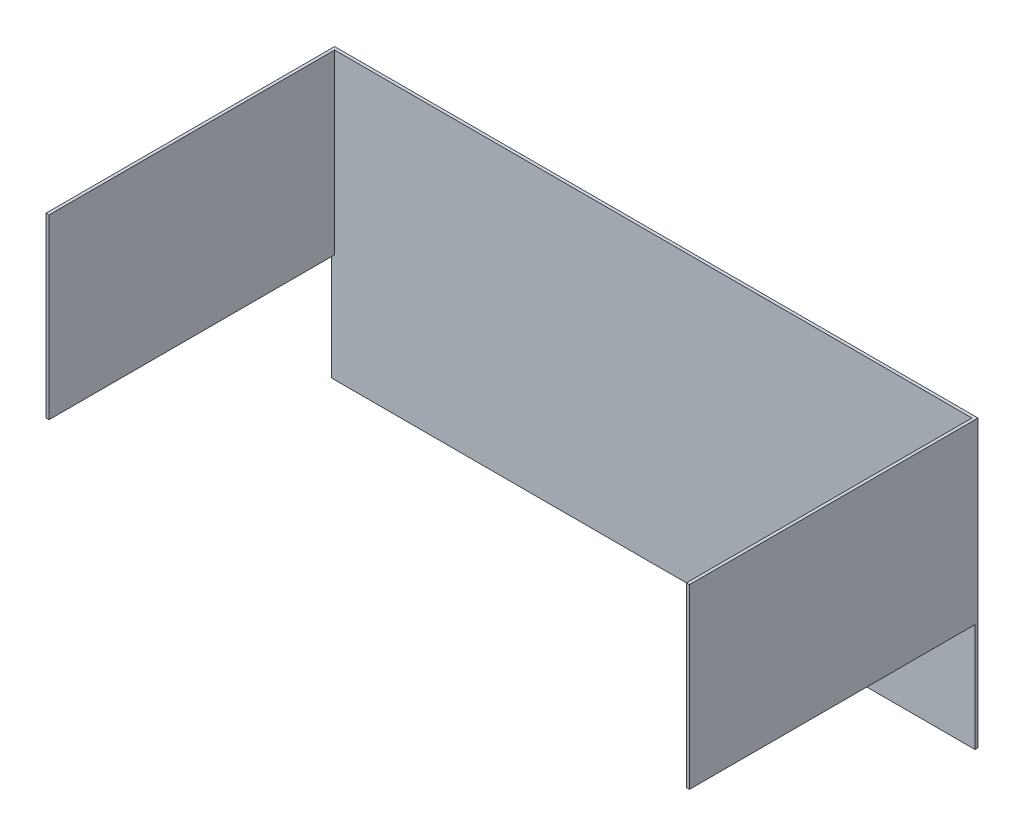
ISO-10303-21;
HEADER;
FILE_DESCRIPTION(('STEP AP214'),'2;1');
FILE_NAME('part.step','',(''),(''),'','','');
FILE_SCHEMA(('AUTOMOTIVE_DESIGN { 1 0 10303 214 1 1 1 1 }'));
ENDSEC;
DATA;
#1=APPLICATION_CONTEXT('core data for automotive mechanical design processes');
#2=APPLICATION_PROTOCOL_DEFINITION('international standard','automotive_design',2000,#1);
#3=PRODUCT_CONTEXT('',#1,'mechanical');
#4=PRODUCT('Part','Part','',(#3));
#5=PRODUCT_RELATED_PRODUCT_CATEGORY('part','',(#4));
#6=PRODUCT_DEFINITION_FORMATION('','',#4);
#7=PRODUCT_DEFINITION_CONTEXT('part definition',#1,'design');
#8=PRODUCT_DEFINITION('design','',#6,#7);
#9=PRODUCT_DEFINITION_SHAPE('','',#8);
#10=(LENGTH_UNIT() NAMED_UNIT(*) SI_UNIT(.MILLI.,.METRE.));
#11=(NAMED_UNIT(*) PLANE_ANGLE_UNIT() SI_UNIT($,.RADIAN.));
#12=(NAMED_UNIT(*) SI_UNIT($,.STERADIAN.) SOLID_ANGLE_UNIT());
#13=UNCERTAINTY_MEASURE_WITH_UNIT(LENGTH_MEASURE(1.E-05),#10,'distance_accuracy_value','');
#14=(GEOMETRIC_REPRESENTATION_CONTEXT(3) GLOBAL_UNCERTAINTY_ASSIGNED_CONTEXT((#13)) GLOBAL_UNIT_ASSIGNED_CONTEXT((#10,
#11,#12)) REPRESENTATION_CONTEXT('',''));
#15=CARTESIAN_POINT('',(0.,0.,0.));
#16=DIRECTION('',(0.,0.,1.));
#17=DIRECTION('',(1.,0.,0.));
#18=AXIS2_PLACEMENT_3D('',#15,#16,#17);
#19=CARTESIAN_POINT('',(-339.725,301.625,152.4));
#20=DIRECTION('',(1.,0.,0.));
#21=DIRECTION('',(0.,0.,-1.));
#22=AXIS2_PLACEMENT_3D('',#19,#20,#21);
#23=PLANE('',#22);
#24=DIRECTION('',(0.,1.,0.));
#25=VECTOR('',#24,1.);
#26=CARTESIAN_POINT('',(-339.725,114.3,-149.225));
#27=LINE('',#26,#25);
#28=CARTESIAN_POINT('',(-339.725,0.,-149.225));
#29=VERTEX_POINT('',#28);
#30=CARTESIAN_POINT('',(-339.725,114.3,-149.225));
#31=VERTEX_POINT('',#30);
#32=EDGE_CURVE('E207',#29,#31,#27,.T.);
#33=ORIENTED_EDGE('',*,*,#32,.T.);
#34=DIRECTION('',(0.,0.,1.));
#35=VECTOR('',#34,1.);
#36=CARTESIAN_POINT('',(-339.725,114.3,152.4));
#37=LINE('',#36,#35);
#38=CARTESIAN_POINT('',(-339.725,114.3,152.4));
#39=VERTEX_POINT('',#38);
#40=EDGE_CURVE('E196',#31,#39,#37,.T.);
#41=ORIENTED_EDGE('',*,*,#40,.T.);
#42=DIRECTION('',(0.,-1.,0.));
#43=VECTOR('',#42,1.);
#44=CARTESIAN_POINT('',(-339.725,301.625,152.4));
#45=LINE('',#44,#43);
#46=CARTESIAN_POINT('',(-339.725,301.625,152.4));
#47=VERTEX_POINT('',#46);
#48=EDGE_CURVE('E11',#47,#39,#45,.T.);
#49=ORIENTED_EDGE('',*,*,#48,.F.);
#50=DIRECTION('',(0.,0.,1.));
#51=VECTOR('',#50,1.);
#52=CARTESIAN_POINT('',(-339.725,301.625,152.4));
#53=LINE('',#52,#51);
#54=CARTESIAN_POINT('',(-339.725,301.625,-152.4));
#55=VERTEX_POINT('',#54);
#56=EDGE_CURVE('E87',#55,#47,#53,.T.);
#57=ORIENTED_EDGE('',*,*,#56,.F.);
#58=DIRECTION('',(0.,-1.,0.));
#59=VECTOR('',#58,1.);
#60=CARTESIAN_POINT('',(-339.725,301.625,-152.4));
#61=LINE('',#60,#59);
#62=CARTESIAN_POINT('',(-339.725,0.,-152.4));
#63=VERTEX_POINT('',#62);
#64=EDGE_CURVE('E136',#55,#63,#61,.T.);
#65=ORIENTED_EDGE('',*,*,#64,.T.);
#66=DIRECTION('',(0.,0.,1.));
#67=VECTOR('',#66,1.);
#68=CARTESIAN_POINT('',(-339.725,0.,152.4));
#69=LINE('',#68,#67);
#70=EDGE_CURVE('E137',#63,#29,#69,.T.);
#71=ORIENTED_EDGE('',*,*,#70,.T.);
#72=EDGE_LOOP('',(#33,#41,#49,#57,#65,#71));
#73=FACE_BOUND('',#72,.T.);
#74=ADVANCED_FACE('F43',(#73),#23,.F.);
#75=CARTESIAN_POINT('',(-336.55,301.625,152.4));
#76=DIRECTION('',(0.,0.,1.));
#77=DIRECTION('',(1.,0.,0.));
#78=AXIS2_PLACEMENT_3D('',#75,#76,#77);
#79=PLANE('',#78);
#80=DIRECTION('',(1.,0.,0.));
#81=VECTOR('',#80,1.);
#82=CARTESIAN_POINT('',(-339.725,114.3,152.4));
#83=LINE('',#82,#81);
#84=CARTESIAN_POINT('',(-336.55,114.3,152.4));
#85=VERTEX_POINT('',#84);
#86=EDGE_CURVE('E170',#39,#85,#83,.T.);
#87=ORIENTED_EDGE('',*,*,#86,.T.);
#88=DIRECTION('',(0.,-1.,0.));
#89=VECTOR('',#88,1.);
#90=CARTESIAN_POINT('',(-336.55,301.625,152.4));
#91=LINE('',#90,#89);
#92=CARTESIAN_POINT('',(-336.55,301.625,152.4));
#93=VERTEX_POINT('',#92);
#94=EDGE_CURVE('E50',#93,#85,#91,.T.);
#95=ORIENTED_EDGE('',*,*,#94,.F.);
#96=DIRECTION('',(-1.,0.,0.));
#97=VECTOR('',#96,1.);
#98=CARTESIAN_POINT('',(-336.55,301.625,152.4));
#99=LINE('',#98,#97);
#100=EDGE_CURVE('E168',#93,#47,#99,.T.);
#101=ORIENTED_EDGE('',*,*,#100,.T.);
#102=ORIENTED_EDGE('',*,*,#48,.T.);
#103=EDGE_LOOP('',(#87,#95,#101,#102));
#104=FACE_BOUND('',#103,.T.);
#105=ADVANCED_FACE('F167',(#104),#79,.T.);
#106=CARTESIAN_POINT('',(-336.55,301.625,152.4));
#107=DIRECTION('',(1.,0.,0.));
#108=DIRECTION('',(0.,0.,-1.));
#109=AXIS2_PLACEMENT_3D('',#106,#107,#108);
#110=PLANE('',#109);
#111=DIRECTION('',(0.,0.,1.));
#112=VECTOR('',#111,1.);
#113=CARTESIAN_POINT('',(-336.55,114.3,152.4));
#114=LINE('',#113,#112);
#115=CARTESIAN_POINT('',(-336.55,114.3,-149.225));
#116=VERTEX_POINT('',#115);
#117=EDGE_CURVE('E140',#116,#85,#114,.T.);
#118=ORIENTED_EDGE('',*,*,#117,.F.);
#119=DIRECTION('',(0.,-1.,0.));
#120=VECTOR('',#119,1.);
#121=CARTESIAN_POINT('',(-336.55,301.625,-149.225));
#122=LINE('',#121,#120);
#123=CARTESIAN_POINT('',(-336.55,301.625,-149.225));
#124=VERTEX_POINT('',#123);
#125=EDGE_CURVE('E151',#124,#116,#122,.T.);
#126=ORIENTED_EDGE('',*,*,#125,.F.);
#127=DIRECTION('',(0.,0.,-1.));
#128=VECTOR('',#127,1.);
#129=CARTESIAN_POINT('',(-336.55,301.625,152.4));
#130=LINE('',#129,#128);
#131=EDGE_CURVE('E162',#124,#93,#130,.F.);
#132=ORIENTED_EDGE('',*,*,#131,.T.);
#133=ORIENTED_EDGE('',*,*,#94,.T.);
#134=EDGE_LOOP('',(#118,#126,#132,#133));
#135=FACE_BOUND('',#134,.T.);
#136=ADVANCED_FACE('F158',(#135),#110,.T.);
#137=CARTESIAN_POINT('',(-339.725,301.625,-149.225));
#138=DIRECTION('',(0.,0.,1.));
#139=DIRECTION('',(1.,0.,0.));
#140=AXIS2_PLACEMENT_3D('',#137,#138,#139);
#141=PLANE('',#140);
#142=ORIENTED_EDGE('',*,*,#125,.T.);
#143=DIRECTION('',(1.,0.,0.));
#144=VECTOR('',#143,1.);
#145=CARTESIAN_POINT('',(-339.725,114.3,-149.225));
#146=LINE('',#145,#144);
#147=EDGE_CURVE('E190',#31,#116,#146,.T.);
#148=ORIENTED_EDGE('',*,*,#147,.F.);
#149=ORIENTED_EDGE('',*,*,#32,.F.);
#150=DIRECTION('',(1.,0.,0.));
#151=VECTOR('',#150,1.);
#152=CARTESIAN_POINT('',(-339.725,0.,-149.225));
#153=LINE('',#152,#151);
#154=CARTESIAN_POINT('',(339.725,0.,-149.225));
#155=VERTEX_POINT('',#154);
#156=EDGE_CURVE('E57',#155,#29,#153,.F.);
#157=ORIENTED_EDGE('',*,*,#156,.F.);
#158=DIRECTION('',(0.,1.,0.));
#159=VECTOR('',#158,1.);
#160=CARTESIAN_POINT('',(339.725,114.3,-149.225));
#161=LINE('',#160,#159);
#162=CARTESIAN_POINT('',(339.725,114.3,-149.225));
#163=VERTEX_POINT('',#162);
#164=EDGE_CURVE('E218',#155,#163,#161,.T.);
#165=ORIENTED_EDGE('',*,*,#164,.T.);
#166=CARTESIAN_POINT('',(336.55,114.3,-149.225));
#167=VERTEX_POINT('',#166);
#168=EDGE_CURVE('E193',#167,#163,#146,.T.);
#169=ORIENTED_EDGE('',*,*,#168,.F.);
#170=DIRECTION('',(0.,-1.,0.));
#171=VECTOR('',#170,1.);
#172=CARTESIAN_POINT('',(336.55,301.625,-149.225));
#173=LINE('',#172,#171);
#174=CARTESIAN_POINT('',(336.55,301.625,-149.225));
#175=VERTEX_POINT('',#174);
#176=EDGE_CURVE('E148',#175,#167,#173,.T.);
#177=ORIENTED_EDGE('',*,*,#176,.F.);
#178=DIRECTION('',(1.,0.,0.));
#179=VECTOR('',#178,1.);
#180=CARTESIAN_POINT('',(-339.725,301.625,-149.225));
#181=LINE('',#180,#179);
#182=EDGE_CURVE('E131',#175,#124,#181,.F.);
#183=ORIENTED_EDGE('',*,*,#182,.T.);
#184=EDGE_LOOP('',(#142,#148,#149,#157,#165,#169,#177,#183));
#185=FACE_BOUND('',#184,.T.);
#186=ADVANCED_FACE('F177',(#185),#141,.T.);
#187=CARTESIAN_POINT('',(336.55,301.625,152.4));
#188=DIRECTION('',(-1.,0.,0.));
#189=DIRECTION('',(0.,0.,1.));
#190=AXIS2_PLACEMENT_3D('',#187,#188,#189);
#191=PLANE('',#190);
#192=DIRECTION('',(0.,0.,-1.));
#193=VECTOR('',#192,1.);
#194=CARTESIAN_POINT('',(336.55,114.3,152.4));
#195=LINE('',#194,#193);
#196=CARTESIAN_POINT('',(336.55,114.3,152.4));
#197=VERTEX_POINT('',#196);
#198=EDGE_CURVE('E184',#197,#167,#195,.T.);
#199=ORIENTED_EDGE('',*,*,#198,.F.);
#200=DIRECTION('',(0.,-1.,0.));
#201=VECTOR('',#200,1.);
#202=CARTESIAN_POINT('',(336.55,301.625,152.4));
#203=LINE('',#202,#201);
#204=CARTESIAN_POINT('',(336.55,301.625,152.4));
#205=VERTEX_POINT('',#204);
#206=EDGE_CURVE('E118',#205,#197,#203,.T.);
#207=ORIENTED_EDGE('',*,*,#206,.F.);
#208=DIRECTION('',(0.,0.,-1.));
#209=VECTOR('',#208,1.);
#210=CARTESIAN_POINT('',(336.55,301.625,152.4));
#211=LINE('',#210,#209);
#212=EDGE_CURVE('E129',#205,#175,#211,.T.);
#213=ORIENTED_EDGE('',*,*,#212,.T.);
#214=ORIENTED_EDGE('',*,*,#176,.T.);
#215=EDGE_LOOP('',(#199,#207,#213,#214));
#216=FACE_BOUND('',#215,.T.);
#217=ADVANCED_FACE('F182',(#216),#191,.T.);
#218=CARTESIAN_POINT('',(339.725,301.625,152.4));
#219=DIRECTION('',(0.,0.,1.));
#220=DIRECTION('',(1.,0.,0.));
#221=AXIS2_PLACEMENT_3D('',#218,#219,#220);
#222=PLANE('',#221);
#223=CARTESIAN_POINT('',(339.725,114.3,152.4));
#224=VERTEX_POINT('',#223);
#225=EDGE_CURVE('E115',#197,#224,#83,.T.);
#226=ORIENTED_EDGE('',*,*,#225,.T.);
#227=DIRECTION('',(0.,-1.,0.));
#228=VECTOR('',#227,1.);
#229=CARTESIAN_POINT('',(339.725,301.625,152.4));
#230=LINE('',#229,#228);
#231=CARTESIAN_POINT('',(339.725,301.625,152.4));
#232=VERTEX_POINT('',#231);
#233=EDGE_CURVE('E107',#232,#224,#230,.T.);
#234=ORIENTED_EDGE('',*,*,#233,.F.);
#235=DIRECTION('',(-1.,0.,0.));
#236=VECTOR('',#235,1.);
#237=CARTESIAN_POINT('',(339.725,301.625,152.4));
#238=LINE('',#237,#236);
#239=EDGE_CURVE('E112',#232,#205,#238,.T.);
#240=ORIENTED_EDGE('',*,*,#239,.T.);
#241=ORIENTED_EDGE('',*,*,#206,.T.);
#242=EDGE_LOOP('',(#226,#234,#240,#241));
#243=FACE_BOUND('',#242,.T.);
#244=ADVANCED_FACE('F109',(#243),#222,.T.);
#245=CARTESIAN_POINT('',(339.725,301.625,152.4));
#246=DIRECTION('',(-1.,0.,0.));
#247=DIRECTION('',(0.,0.,1.));
#248=AXIS2_PLACEMENT_3D('',#245,#246,#247);
#249=PLANE('',#248);
#250=ORIENTED_EDGE('',*,*,#233,.T.);
#251=DIRECTION('',(0.,0.,1.));
#252=VECTOR('',#251,1.);
#253=CARTESIAN_POINT('',(339.725,114.3,152.4));
#254=LINE('',#253,#252);
#255=EDGE_CURVE('E189',#163,#224,#254,.T.);
#256=ORIENTED_EDGE('',*,*,#255,.F.);
#257=ORIENTED_EDGE('',*,*,#164,.F.);
#258=DIRECTION('',(0.,0.,-1.));
#259=VECTOR('',#258,1.);
#260=CARTESIAN_POINT('',(339.725,0.,152.4));
#261=LINE('',#260,#259);
#262=CARTESIAN_POINT('',(339.725,0.,-152.4));
#263=VERTEX_POINT('',#262);
#264=EDGE_CURVE('E142',#155,#263,#261,.T.);
#265=ORIENTED_EDGE('',*,*,#264,.T.);
#266=DIRECTION('',(0.,-1.,0.));
#267=VECTOR('',#266,1.);
#268=CARTESIAN_POINT('',(339.725,301.625,-152.4));
#269=LINE('',#268,#267);
#270=CARTESIAN_POINT('',(339.725,301.625,-152.4));
#271=VERTEX_POINT('',#270);
#272=EDGE_CURVE('E119',#271,#263,#269,.T.);
#273=ORIENTED_EDGE('',*,*,#272,.F.);
#274=DIRECTION('',(0.,0.,-1.));
#275=VECTOR('',#274,1.);
#276=CARTESIAN_POINT('',(339.725,301.625,152.4));
#277=LINE('',#276,#275);
#278=EDGE_CURVE('E122',#232,#271,#277,.T.);
#279=ORIENTED_EDGE('',*,*,#278,.F.);
#280=EDGE_LOOP('',(#250,#256,#257,#265,#273,#279));
#281=FACE_BOUND('',#280,.T.);
#282=ADVANCED_FACE('F123',(#281),#249,.F.);
#283=CARTESIAN_POINT('',(-339.725,301.625,-152.4));
#284=DIRECTION('',(0.,0.,1.));
#285=DIRECTION('',(1.,0.,0.));
#286=AXIS2_PLACEMENT_3D('',#283,#284,#285);
#287=PLANE('',#286);
#288=DIRECTION('',(-1.,0.,0.));
#289=VECTOR('',#288,1.);
#290=CARTESIAN_POINT('',(-339.725,0.,-152.4));
#291=LINE('',#290,#289);
#292=EDGE_CURVE('E81',#263,#63,#291,.T.);
#293=ORIENTED_EDGE('',*,*,#292,.T.);
#294=ORIENTED_EDGE('',*,*,#64,.F.);
#295=DIRECTION('',(-1.,0.,0.));
#296=VECTOR('',#295,1.);
#297=CARTESIAN_POINT('',(-339.725,301.625,-152.4));
#298=LINE('',#297,#296);
#299=EDGE_CURVE('E66',#271,#55,#298,.T.);
#300=ORIENTED_EDGE('',*,*,#299,.F.);
#301=ORIENTED_EDGE('',*,*,#272,.T.);
#302=EDGE_LOOP('',(#293,#294,#300,#301));
#303=FACE_BOUND('',#302,.T.);
#304=ADVANCED_FACE('F222',(#303),#287,.F.);
#305=CARTESIAN_POINT('',(0.,301.625,0.));
#306=DIRECTION('',(0.,-1.,0.));
#307=DIRECTION('',(-1.,0.,0.));
#308=AXIS2_PLACEMENT_3D('',#305,#306,#307);
#309=PLANE('',#308);
#310=ORIENTED_EDGE('',*,*,#56,.T.);
#311=ORIENTED_EDGE('',*,*,#100,.F.);
#312=ORIENTED_EDGE('',*,*,#131,.F.);
#313=ORIENTED_EDGE('',*,*,#182,.F.);
#314=ORIENTED_EDGE('',*,*,#212,.F.);
#315=ORIENTED_EDGE('',*,*,#239,.F.);
#316=ORIENTED_EDGE('',*,*,#278,.T.);
#317=ORIENTED_EDGE('',*,*,#299,.T.);
#318=EDGE_LOOP('',(#310,#311,#312,#313,#314,#315,#316,#317));
#319=FACE_BOUND('',#318,.T.);
#320=ADVANCED_FACE('F126',(#319),#309,.F.);
#321=CARTESIAN_POINT('',(0.,0.,0.));
#322=DIRECTION('',(0.,-1.,0.));
#323=DIRECTION('',(-1.,0.,0.));
#324=AXIS2_PLACEMENT_3D('',#321,#322,#323);
#325=PLANE('',#324);
#326=ORIENTED_EDGE('',*,*,#156,.T.);
#327=ORIENTED_EDGE('',*,*,#70,.F.);
#328=ORIENTED_EDGE('',*,*,#292,.F.);
#329=ORIENTED_EDGE('',*,*,#264,.F.);
#330=EDGE_LOOP('',(#326,#327,#328,#329));
#331=FACE_BOUND('',#330,.T.);
#332=ADVANCED_FACE('F220',(#331),#325,.T.);
#333=CARTESIAN_POINT('',(-339.725,114.3,152.4));
#334=DIRECTION('',(0.,1.,0.));
#335=DIRECTION('',(0.,0.,1.));
#336=AXIS2_PLACEMENT_3D('',#333,#334,#335);
#337=PLANE('',#336);
#338=ORIENTED_EDGE('',*,*,#198,.T.);
#339=ORIENTED_EDGE('',*,*,#168,.T.);
#340=ORIENTED_EDGE('',*,*,#255,.T.);
#341=ORIENTED_EDGE('',*,*,#225,.F.);
#342=EDGE_LOOP('',(#338,#339,#340,#341));
#343=FACE_BOUND('',#342,.T.);
#344=ADVANCED_FACE('F187',(#343),#337,.F.);
#345=ORIENTED_EDGE('',*,*,#117,.T.);
#346=ORIENTED_EDGE('',*,*,#86,.F.);
#347=ORIENTED_EDGE('',*,*,#40,.F.);
#348=ORIENTED_EDGE('',*,*,#147,.T.);
#349=EDGE_LOOP('',(#345,#346,#347,#348));
#350=FACE_BOUND('',#349,.T.);
#351=ADVANCED_FACE('F200',(#350),#337,.F.);
#352=CLOSED_SHELL('',(#74,#105,#136,#186,#217,#244,#282,#304,#320,#332,#344,#351));
#353=MANIFOLD_SOLID_BREP('B2',#352);
#354=ADVANCED_BREP_SHAPE_REPRESENTATION('',(#18,#353),#14);
#355=SHAPE_DEFINITION_REPRESENTATION(#9,#354);
ENDSEC;
END-ISO-10303-21;
